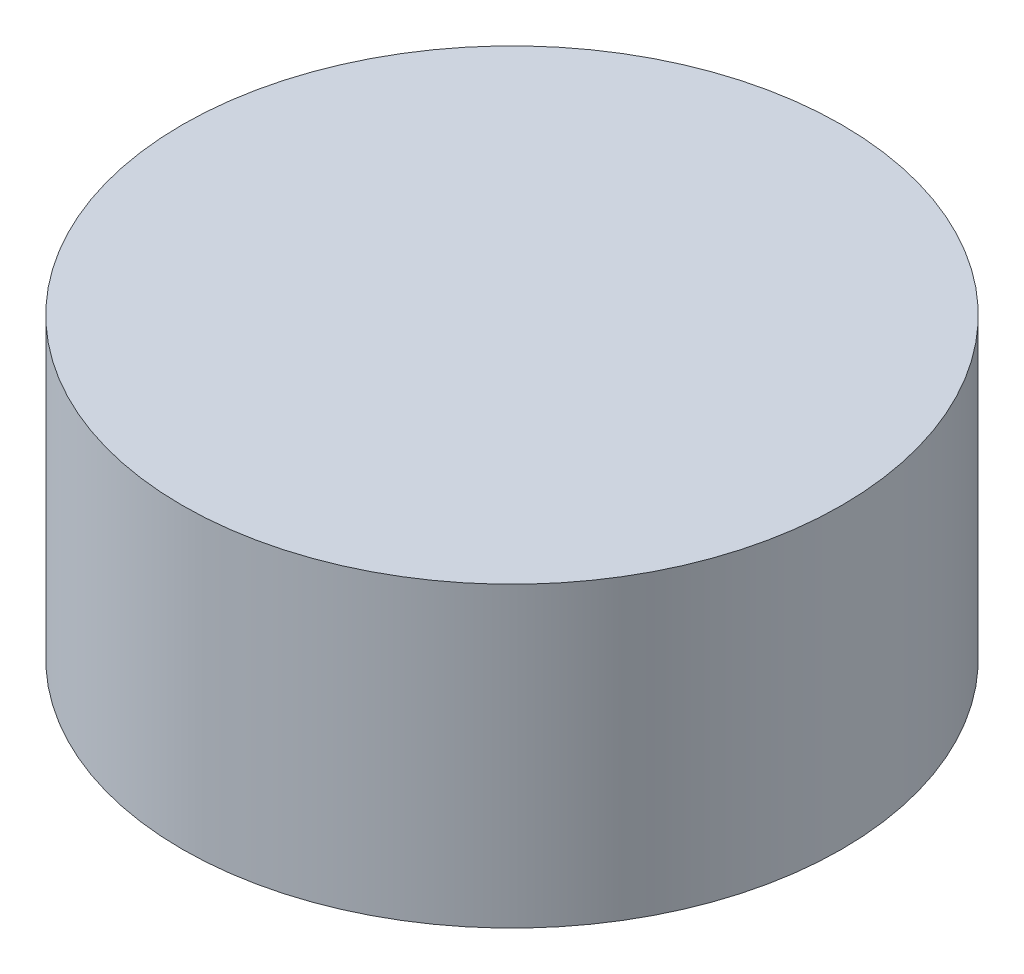
ISO-10303-21;
HEADER;
FILE_DESCRIPTION(('STEP AP214'),'2;1');
FILE_NAME('part.step','',(''),(''),'','','');
FILE_SCHEMA(('AUTOMOTIVE_DESIGN { 1 0 10303 214 1 1 1 1 }'));
ENDSEC;
DATA;
#1=APPLICATION_CONTEXT('core data for automotive mechanical design processes');
#2=APPLICATION_PROTOCOL_DEFINITION('international standard','automotive_design',2000,#1);
#3=PRODUCT_CONTEXT('',#1,'mechanical');
#4=PRODUCT('Part','Part','',(#3));
#5=PRODUCT_RELATED_PRODUCT_CATEGORY('part','',(#4));
#6=PRODUCT_DEFINITION_FORMATION('','',#4);
#7=PRODUCT_DEFINITION_CONTEXT('part definition',#1,'design');
#8=PRODUCT_DEFINITION('design','',#6,#7);
#9=PRODUCT_DEFINITION_SHAPE('','',#8);
#10=(LENGTH_UNIT() NAMED_UNIT(*) SI_UNIT(.MILLI.,.METRE.));
#11=(NAMED_UNIT(*) PLANE_ANGLE_UNIT() SI_UNIT($,.RADIAN.));
#12=(NAMED_UNIT(*) SI_UNIT($,.STERADIAN.) SOLID_ANGLE_UNIT());
#13=UNCERTAINTY_MEASURE_WITH_UNIT(LENGTH_MEASURE(1.E-05),#10,'distance_accuracy_value','');
#14=(GEOMETRIC_REPRESENTATION_CONTEXT(3) GLOBAL_UNCERTAINTY_ASSIGNED_CONTEXT((#13)) GLOBAL_UNIT_ASSIGNED_CONTEXT((#10,
#11,#12)) REPRESENTATION_CONTEXT('',''));
#15=CARTESIAN_POINT('',(0.,0.,0.));
#16=DIRECTION('',(0.,0.,1.));
#17=DIRECTION('',(1.,0.,0.));
#18=AXIS2_PLACEMENT_3D('',#15,#16,#17);
#19=CARTESIAN_POINT('',(0.,7.,0.));
#20=DIRECTION('',(0.,-1.,0.));
#21=DIRECTION('',(0.,0.,-1.));
#22=AXIS2_PLACEMENT_3D('',#19,#20,#21);
#23=CYLINDRICAL_SURFACE('',#22,7.75);
#24=CARTESIAN_POINT('',(0.,7.,0.));
#25=DIRECTION('',(0.,1.,0.));
#26=DIRECTION('',(0.,0.,1.));
#27=AXIS2_PLACEMENT_3D('',#24,#25,#26);
#28=CIRCLE('',#27,7.75);
#29=CARTESIAN_POINT('',(0.,7.,7.75));
#30=VERTEX_POINT('',#29);
#31=EDGE_CURVE('E10',#30,#30,#28,.T.);
#32=ORIENTED_EDGE('',*,*,#31,.F.);
#33=EDGE_LOOP('',(#32));
#34=FACE_BOUND('',#33,.T.);
#35=CARTESIAN_POINT('',(0.,0.,0.));
#36=DIRECTION('',(0.,1.,0.));
#37=DIRECTION('',(0.,0.,1.));
#38=AXIS2_PLACEMENT_3D('',#35,#36,#37);
#39=CIRCLE('',#38,7.75);
#40=CARTESIAN_POINT('',(0.,0.,7.75));
#41=VERTEX_POINT('',#40);
#42=EDGE_CURVE('E34',#41,#41,#39,.T.);
#43=ORIENTED_EDGE('',*,*,#42,.T.);
#44=EDGE_LOOP('',(#43));
#45=FACE_BOUND('',#44,.T.);
#46=ADVANCED_FACE('F31',(#34,#45),#23,.T.);
#47=CARTESIAN_POINT('',(0.,7.,0.));
#48=DIRECTION('',(0.,1.,0.));
#49=DIRECTION('',(0.,0.,1.));
#50=AXIS2_PLACEMENT_3D('',#47,#48,#49);
#51=PLANE('',#50);
#52=ORIENTED_EDGE('',*,*,#31,.T.);
#53=EDGE_LOOP('',(#52));
#54=FACE_BOUND('',#53,.T.);
#55=ADVANCED_FACE('F46',(#54),#51,.T.);
#56=CARTESIAN_POINT('',(0.,0.,0.));
#57=DIRECTION('',(0.,1.,0.));
#58=DIRECTION('',(0.,0.,1.));
#59=AXIS2_PLACEMENT_3D('',#56,#57,#58);
#60=PLANE('',#59);
#61=ORIENTED_EDGE('',*,*,#42,.F.);
#62=EDGE_LOOP('',(#61));
#63=FACE_BOUND('',#62,.T.);
#64=ADVANCED_FACE('F44',(#63),#60,.F.);
#65=CLOSED_SHELL('',(#46,#55,#64));
#66=MANIFOLD_SOLID_BREP('B2',#65);
#67=ADVANCED_BREP_SHAPE_REPRESENTATION('',(#18,#66),#14);
#68=SHAPE_DEFINITION_REPRESENTATION(#9,#67);
ENDSEC;
END-ISO-10303-21;
